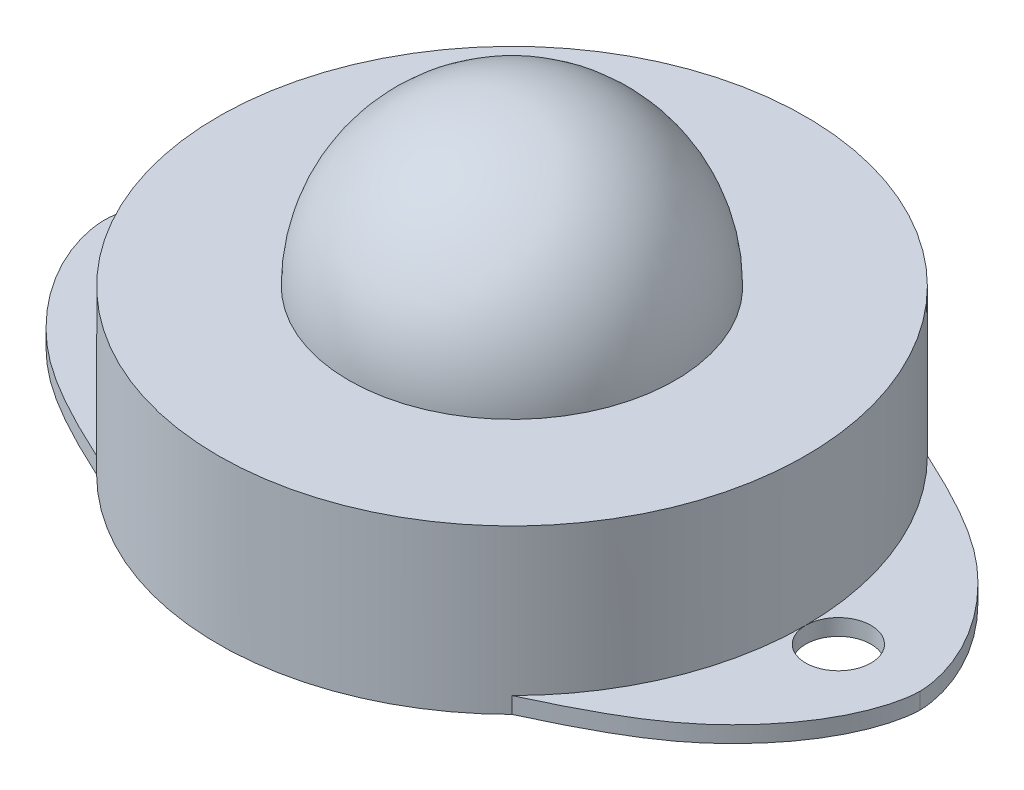
ISO-10303-21;
HEADER;
FILE_DESCRIPTION(('STEP AP214'),'2;1');
FILE_NAME('part.step','',(''),(''),'','','');
FILE_SCHEMA(('AUTOMOTIVE_DESIGN { 1 0 10303 214 1 1 1 1 }'));
ENDSEC;
DATA;
#1=APPLICATION_CONTEXT('core data for automotive mechanical design processes');
#2=APPLICATION_PROTOCOL_DEFINITION('international standard','automotive_design',2000,#1);
#3=PRODUCT_CONTEXT('',#1,'mechanical');
#4=PRODUCT('Part','Part','',(#3));
#5=PRODUCT_RELATED_PRODUCT_CATEGORY('part','',(#4));
#6=PRODUCT_DEFINITION_FORMATION('','',#4);
#7=PRODUCT_DEFINITION_CONTEXT('part definition',#1,'design');
#8=PRODUCT_DEFINITION('design','',#6,#7);
#9=PRODUCT_DEFINITION_SHAPE('','',#8);
#10=(LENGTH_UNIT() NAMED_UNIT(*) SI_UNIT(.MILLI.,.METRE.));
#11=(NAMED_UNIT(*) PLANE_ANGLE_UNIT() SI_UNIT($,.RADIAN.));
#12=(NAMED_UNIT(*) SI_UNIT($,.STERADIAN.) SOLID_ANGLE_UNIT());
#13=UNCERTAINTY_MEASURE_WITH_UNIT(LENGTH_MEASURE(1.E-05),#10,'distance_accuracy_value','');
#14=(GEOMETRIC_REPRESENTATION_CONTEXT(3) GLOBAL_UNCERTAINTY_ASSIGNED_CONTEXT((#13)) GLOBAL_UNIT_ASSIGNED_CONTEXT((#10,
#11,#12)) REPRESENTATION_CONTEXT('',''));
#15=CARTESIAN_POINT('',(0.,0.,0.));
#16=DIRECTION('',(0.,0.,1.));
#17=DIRECTION('',(1.,0.,0.));
#18=AXIS2_PLACEMENT_3D('',#15,#16,#17);
#19=CARTESIAN_POINT('',(0.,10.,0.));
#20=DIRECTION('',(0.,-1.,0.));
#21=DIRECTION('',(0.,0.,-1.));
#22=AXIS2_PLACEMENT_3D('',#19,#20,#21);
#23=CYLINDRICAL_SURFACE('',#22,18.);
#24=CARTESIAN_POINT('',(0.,1.,0.));
#25=DIRECTION('',(0.,-1.,0.));
#26=DIRECTION('',(0.,0.,-1.));
#27=AXIS2_PLACEMENT_3D('',#24,#25,#26);
#28=CIRCLE('',#27,18.);
#29=CARTESIAN_POINT('',(18.,1.,0.));
#30=VERTEX_POINT('',#29);
#31=CARTESIAN_POINT('',(12.7279220613579,0.999999999999999,12.7279220613578));
#32=VERTEX_POINT('',#31);
#33=EDGE_CURVE('E103',#30,#32,#28,.T.);
#34=ORIENTED_EDGE('',*,*,#33,.F.);
#35=CARTESIAN_POINT('',(12.7279220613579,0.999999999999999,-12.7279220613578));
#36=VERTEX_POINT('',#35);
#37=EDGE_CURVE('E122',#36,#30,#28,.T.);
#38=ORIENTED_EDGE('',*,*,#37,.F.);
#39=DIRECTION('',(0.,-1.,0.));
#40=VECTOR('',#39,1.);
#41=CARTESIAN_POINT('',(12.7279220613579,1.,-12.7279220613578));
#42=LINE('',#41,#40);
#43=CARTESIAN_POINT('',(12.7279220613579,0.,-12.7279220613578));
#44=VERTEX_POINT('',#43);
#45=EDGE_CURVE('E107',#36,#44,#42,.T.);
#46=ORIENTED_EDGE('',*,*,#45,.T.);
#47=CARTESIAN_POINT('',(0.,0.,0.));
#48=DIRECTION('',(0.,1.,0.));
#49=DIRECTION('',(0.,0.,1.));
#50=AXIS2_PLACEMENT_3D('',#47,#48,#49);
#51=CIRCLE('',#50,18.);
#52=CARTESIAN_POINT('',(-12.7279220613579,0.,-12.7279220613578));
#53=VERTEX_POINT('',#52);
#54=EDGE_CURVE('E184',#44,#53,#51,.T.);
#55=ORIENTED_EDGE('',*,*,#54,.T.);
#56=DIRECTION('',(0.,-1.,0.));
#57=VECTOR('',#56,1.);
#58=CARTESIAN_POINT('',(-12.7279220613579,1.,-12.7279220613578));
#59=LINE('',#58,#57);
#60=CARTESIAN_POINT('',(-12.7279220613579,0.999999999999999,-12.7279220613578));
#61=VERTEX_POINT('',#60);
#62=EDGE_CURVE('E160',#61,#53,#59,.T.);
#63=ORIENTED_EDGE('',*,*,#62,.F.);
#64=CARTESIAN_POINT('',(0.,1.,0.));
#65=DIRECTION('',(0.,-1.,0.));
#66=DIRECTION('',(0.,0.,-1.));
#67=AXIS2_PLACEMENT_3D('',#64,#65,#66);
#68=CIRCLE('',#67,18.);
#69=CARTESIAN_POINT('',(-18.,1.,0.));
#70=VERTEX_POINT('',#69);
#71=EDGE_CURVE('E237',#70,#61,#68,.T.);
#72=ORIENTED_EDGE('',*,*,#71,.F.);
#73=CARTESIAN_POINT('',(-12.7279220613579,0.999999999999999,12.7279220613578));
#74=VERTEX_POINT('',#73);
#75=EDGE_CURVE('E161',#74,#70,#68,.T.);
#76=ORIENTED_EDGE('',*,*,#75,.F.);
#77=DIRECTION('',(0.,-1.,0.));
#78=VECTOR('',#77,1.);
#79=CARTESIAN_POINT('',(-12.7279220613579,1.,12.7279220613578));
#80=LINE('',#79,#78);
#81=CARTESIAN_POINT('',(-12.7279220613579,0.,12.7279220613578));
#82=VERTEX_POINT('',#81);
#83=EDGE_CURVE('E185',#74,#82,#80,.T.);
#84=ORIENTED_EDGE('',*,*,#83,.T.);
#85=CARTESIAN_POINT('',(12.7279220613579,0.,12.7279220613578));
#86=VERTEX_POINT('',#85);
#87=EDGE_CURVE('E45',#82,#86,#51,.T.);
#88=ORIENTED_EDGE('',*,*,#87,.T.);
#89=DIRECTION('',(0.,-1.,0.));
#90=VECTOR('',#89,1.);
#91=CARTESIAN_POINT('',(12.7279220613579,1.,12.7279220613578));
#92=LINE('',#91,#90);
#93=EDGE_CURVE('E117',#32,#86,#92,.T.);
#94=ORIENTED_EDGE('',*,*,#93,.F.);
#95=EDGE_LOOP('',(#34,#38,#46,#55,#63,#72,#76,#84,#88,#94));
#96=FACE_BOUND('',#95,.T.);
#97=CARTESIAN_POINT('',(0.,10.,0.));
#98=DIRECTION('',(0.,1.,0.));
#99=DIRECTION('',(0.,0.,1.));
#100=AXIS2_PLACEMENT_3D('',#97,#98,#99);
#101=CIRCLE('',#100,18.);
#102=CARTESIAN_POINT('',(0.,10.,18.));
#103=VERTEX_POINT('',#102);
#104=EDGE_CURVE('E11',#103,#103,#101,.T.);
#105=ORIENTED_EDGE('',*,*,#104,.F.);
#106=EDGE_LOOP('',(#105));
#107=FACE_BOUND('',#106,.T.);
#108=ADVANCED_FACE('F37',(#96,#107),#23,.T.);
#109=CARTESIAN_POINT('',(0.,10.,0.));
#110=DIRECTION('',(0.,1.,0.));
#111=DIRECTION('',(0.,0.,1.));
#112=AXIS2_PLACEMENT_3D('',#109,#110,#111);
#113=PLANE('',#112);
#114=CARTESIAN_POINT('',(0.,10.,0.));
#115=DIRECTION('',(0.,1.,0.));
#116=DIRECTION('',(0.,0.,1.));
#117=AXIS2_PLACEMENT_3D('',#114,#115,#116);
#118=CIRCLE('',#117,10.);
#119=CARTESIAN_POINT('',(0.,10.,10.));
#120=VERTEX_POINT('',#119);
#121=EDGE_CURVE('E40',#120,#120,#118,.F.);
#122=ORIENTED_EDGE('',*,*,#121,.T.);
#123=EDGE_LOOP('',(#122));
#124=FACE_BOUND('',#123,.T.);
#125=ORIENTED_EDGE('',*,*,#104,.T.);
#126=EDGE_LOOP('',(#125));
#127=FACE_BOUND('',#126,.T.);
#128=ADVANCED_FACE('F204',(#124,#127),#113,.T.);
#129=CARTESIAN_POINT('',(0.,0.,0.));
#130=DIRECTION('',(0.,1.,0.));
#131=DIRECTION('',(0.,0.,1.));
#132=AXIS2_PLACEMENT_3D('',#129,#130,#131);
#133=PLANE('',#132);
#134=CARTESIAN_POINT('',(0.,0.,0.));
#135=VERTEX_POINT('',#134);
#136=VERTEX_LOOP('',#135);
#137=FACE_BOUND('',#136,.T.);
#138=CARTESIAN_POINT('',(20.,0.,0.));
#139=DIRECTION('',(0.,-1.,0.));
#140=DIRECTION('',(0.,0.,-1.));
#141=AXIS2_PLACEMENT_3D('',#138,#139,#140);
#142=CIRCLE('',#141,2.);
#143=CARTESIAN_POINT('',(20.,0.,-2.));
#144=VERTEX_POINT('',#143);
#145=EDGE_CURVE('E195',#144,#144,#142,.T.);
#146=ORIENTED_EDGE('',*,*,#145,.F.);
#147=EDGE_LOOP('',(#146));
#148=FACE_BOUND('',#147,.T.);
#149=CARTESIAN_POINT('',(-20.,0.,0.));
#150=DIRECTION('',(0.,-1.,0.));
#151=DIRECTION('',(0.,0.,-1.));
#152=AXIS2_PLACEMENT_3D('',#149,#150,#151);
#153=CIRCLE('',#152,2.);
#154=CARTESIAN_POINT('',(-20.,0.,-2.));
#155=VERTEX_POINT('',#154);
#156=EDGE_CURVE('E194',#155,#155,#153,.T.);
#157=ORIENTED_EDGE('',*,*,#156,.F.);
#158=EDGE_LOOP('',(#157));
#159=FACE_BOUND('',#158,.T.);
#160=ORIENTED_EDGE('',*,*,#87,.F.);
#161=CARTESIAN_POINT('',(-12.7279220613579,0.,12.7279220613578));
#162=CARTESIAN_POINT('',(-17.413514116372,0.,10.5789412860504));
#163=CARTESIAN_POINT('',(-23.9251464222868,0.,5.76683159903035));
#164=CARTESIAN_POINT('',(-25.,0.,1.29391370312394));
#165=CARTESIAN_POINT('',(-25.,0.,0.));
#166=B_SPLINE_CURVE_WITH_KNOTS('',3,(#161,#162,#163,#164,#165),.UNSPECIFIED.,.F.,.F.,(4,1,4),
(0.,0.294966876513877,1.),.UNSPECIFIED.);
#167=CARTESIAN_POINT('',(-25.,0.,0.));
#168=VERTEX_POINT('',#167);
#169=EDGE_CURVE('E170',#82,#168,#166,.T.);
#170=ORIENTED_EDGE('',*,*,#169,.T.);
#171=CARTESIAN_POINT('',(-12.7279220613579,0.,-12.7279220613578));
#172=CARTESIAN_POINT('',(-17.413514116372,0.,-10.5789412860504));
#173=CARTESIAN_POINT('',(-23.9251464222868,0.,-5.76683159903035));
#174=CARTESIAN_POINT('',(-25.,0.,-1.29391370312394));
#175=CARTESIAN_POINT('',(-25.,0.,0.));
#176=B_SPLINE_CURVE_WITH_KNOTS('',3,(#171,#172,#173,#174,#175),.UNSPECIFIED.,.F.,.F.,(4,1,4),
(0.,0.294966876513877,1.),.UNSPECIFIED.);
#177=EDGE_CURVE('E162',#53,#168,#176,.T.);
#178=ORIENTED_EDGE('',*,*,#177,.F.);
#179=ORIENTED_EDGE('',*,*,#54,.F.);
#180=CARTESIAN_POINT('',(12.7279220613579,0.,-12.7279220613578));
#181=CARTESIAN_POINT('',(17.413514116372,0.,-10.5789412860504));
#182=CARTESIAN_POINT('',(23.9251464222868,0.,-5.76683159903034));
#183=CARTESIAN_POINT('',(25.,0.,-1.29391370312393));
#184=CARTESIAN_POINT('',(25.,0.,0.));
#185=B_SPLINE_CURVE_WITH_KNOTS('',3,(#180,#181,#182,#183,#184),.UNSPECIFIED.,.F.,.F.,(4,1,4),
(0.,0.294966876513877,1.),.UNSPECIFIED.);
#186=CARTESIAN_POINT('',(25.,0.,0.));
#187=VERTEX_POINT('',#186);
#188=EDGE_CURVE('E193',#44,#187,#185,.T.);
#189=ORIENTED_EDGE('',*,*,#188,.T.);
#190=CARTESIAN_POINT('',(12.7279220613579,0.,12.7279220613578));
#191=CARTESIAN_POINT('',(17.413514116372,0.,10.5789412860504));
#192=CARTESIAN_POINT('',(23.9251464222868,0.,5.76683159903034));
#193=CARTESIAN_POINT('',(25.,0.,1.29391370312394));
#194=CARTESIAN_POINT('',(25.,0.,0.));
#195=B_SPLINE_CURVE_WITH_KNOTS('',3,(#190,#191,#192,#193,#194),.UNSPECIFIED.,.F.,.F.,(4,1,4),
(0.,0.294966876513877,1.),.UNSPECIFIED.);
#196=EDGE_CURVE('E113',#86,#187,#195,.T.);
#197=ORIENTED_EDGE('',*,*,#196,.F.);
#198=EDGE_LOOP('',(#160,#170,#178,#179,#189,#197));
#199=FACE_BOUND('',#198,.T.);
#200=ADVANCED_FACE('F221',(#137,#148,#159,#199),#133,.F.);
#201=CARTESIAN_POINT('',(-12.7279220613579,1.,-12.7279220613578));
#202=CARTESIAN_POINT('',(-17.413514116372,1.,-10.5789412860504));
#203=CARTESIAN_POINT('',(-23.9251464222868,1.,-5.76683159903035));
#204=CARTESIAN_POINT('',(-25.,1.,-1.29391370312394));
#205=CARTESIAN_POINT('',(-25.,1.,0.));
#206=B_SPLINE_CURVE_WITH_KNOTS('',3,(#201,#202,#203,#204,#205),.UNSPECIFIED.,.F.,.F.,(4,1,4),
(0.,0.294966876513877,1.),.UNSPECIFIED.);
#207=DIRECTION('',(0.,-1.,0.));
#208=VECTOR('',#207,1.);
#209=SURFACE_OF_LINEAR_EXTRUSION('',#206,#208);
#210=ORIENTED_EDGE('',*,*,#177,.T.);
#211=DIRECTION('',(0.,-1.,0.));
#212=VECTOR('',#211,1.);
#213=CARTESIAN_POINT('',(-25.,1.,0.));
#214=LINE('',#213,#212);
#215=CARTESIAN_POINT('',(-25.,1.,0.));
#216=VERTEX_POINT('',#215);
#217=EDGE_CURVE('E179',#216,#168,#214,.T.);
#218=ORIENTED_EDGE('',*,*,#217,.F.);
#219=EDGE_CURVE('E178',#61,#216,#206,.T.);
#220=ORIENTED_EDGE('',*,*,#219,.F.);
#221=ORIENTED_EDGE('',*,*,#62,.T.);
#222=EDGE_LOOP('',(#210,#218,#220,#221));
#223=FACE_BOUND('',#222,.T.);
#224=ADVANCED_FACE('F149',(#223),#209,.F.);
#225=CARTESIAN_POINT('',(-12.7279220613579,1.,12.7279220613578));
#226=CARTESIAN_POINT('',(-17.413514116372,1.,10.5789412860504));
#227=CARTESIAN_POINT('',(-23.9251464222868,1.,5.76683159903035));
#228=CARTESIAN_POINT('',(-25.,1.,1.29391370312394));
#229=CARTESIAN_POINT('',(-25.,1.,0.));
#230=B_SPLINE_CURVE_WITH_KNOTS('',3,(#225,#226,#227,#228,#229),.UNSPECIFIED.,.F.,.F.,(4,1,4),
(0.,0.294966876513877,1.),.UNSPECIFIED.);
#231=DIRECTION('',(0.,-1.,0.));
#232=VECTOR('',#231,1.);
#233=SURFACE_OF_LINEAR_EXTRUSION('',#230,#232);
#234=ORIENTED_EDGE('',*,*,#169,.F.);
#235=ORIENTED_EDGE('',*,*,#83,.F.);
#236=EDGE_CURVE('E153',#74,#216,#230,.T.);
#237=ORIENTED_EDGE('',*,*,#236,.T.);
#238=ORIENTED_EDGE('',*,*,#217,.T.);
#239=EDGE_LOOP('',(#234,#235,#237,#238));
#240=FACE_BOUND('',#239,.T.);
#241=ADVANCED_FACE('F144',(#240),#233,.T.);
#242=CARTESIAN_POINT('',(0.,1.,0.));
#243=DIRECTION('',(0.,-1.,0.));
#244=DIRECTION('',(0.,0.,-1.));
#245=AXIS2_PLACEMENT_3D('',#242,#243,#244);
#246=PLANE('',#245);
#247=ORIENTED_EDGE('',*,*,#75,.T.);
#248=CARTESIAN_POINT('',(-20.,1.,0.));
#249=DIRECTION('',(0.,-1.,0.));
#250=DIRECTION('',(0.,0.,-1.));
#251=AXIS2_PLACEMENT_3D('',#248,#249,#250);
#252=CIRCLE('',#251,2.);
#253=EDGE_CURVE('E191',#70,#70,#252,.T.);
#254=ORIENTED_EDGE('',*,*,#253,.T.);
#255=ORIENTED_EDGE('',*,*,#71,.T.);
#256=ORIENTED_EDGE('',*,*,#219,.T.);
#257=ORIENTED_EDGE('',*,*,#236,.F.);
#258=EDGE_LOOP('',(#247,#254,#255,#256,#257));
#259=FACE_BOUND('',#258,.T.);
#260=ADVANCED_FACE('F141',(#259),#246,.F.);
#261=CARTESIAN_POINT('',(12.7279220613579,1.,12.7279220613578));
#262=CARTESIAN_POINT('',(17.413514116372,1.,10.5789412860504));
#263=CARTESIAN_POINT('',(23.9251464222868,1.,5.76683159903034));
#264=CARTESIAN_POINT('',(25.,1.,1.29391370312394));
#265=CARTESIAN_POINT('',(25.,1.,0.));
#266=B_SPLINE_CURVE_WITH_KNOTS('',3,(#261,#262,#263,#264,#265),.UNSPECIFIED.,.F.,.F.,(4,1,4),
(0.,0.294966876513877,1.),.UNSPECIFIED.);
#267=DIRECTION('',(0.,-1.,0.));
#268=VECTOR('',#267,1.);
#269=SURFACE_OF_LINEAR_EXTRUSION('',#266,#268);
#270=ORIENTED_EDGE('',*,*,#196,.T.);
#271=DIRECTION('',(0.,-1.,0.));
#272=VECTOR('',#271,1.);
#273=CARTESIAN_POINT('',(25.,1.,0.));
#274=LINE('',#273,#272);
#275=CARTESIAN_POINT('',(25.,1.,0.));
#276=VERTEX_POINT('',#275);
#277=EDGE_CURVE('E110',#276,#187,#274,.T.);
#278=ORIENTED_EDGE('',*,*,#277,.F.);
#279=EDGE_CURVE('E96',#32,#276,#266,.T.);
#280=ORIENTED_EDGE('',*,*,#279,.F.);
#281=ORIENTED_EDGE('',*,*,#93,.T.);
#282=EDGE_LOOP('',(#270,#278,#280,#281));
#283=FACE_BOUND('',#282,.T.);
#284=ADVANCED_FACE('F111',(#283),#269,.F.);
#285=CARTESIAN_POINT('',(12.7279220613579,1.,-12.7279220613578));
#286=CARTESIAN_POINT('',(17.413514116372,1.,-10.5789412860504));
#287=CARTESIAN_POINT('',(23.9251464222868,1.,-5.76683159903034));
#288=CARTESIAN_POINT('',(25.,1.,-1.29391370312393));
#289=CARTESIAN_POINT('',(25.,1.,0.));
#290=B_SPLINE_CURVE_WITH_KNOTS('',3,(#285,#286,#287,#288,#289),.UNSPECIFIED.,.F.,.F.,(4,1,4),
(0.,0.294966876513877,1.),.UNSPECIFIED.);
#291=DIRECTION('',(0.,-1.,0.));
#292=VECTOR('',#291,1.);
#293=SURFACE_OF_LINEAR_EXTRUSION('',#290,#292);
#294=ORIENTED_EDGE('',*,*,#188,.F.);
#295=ORIENTED_EDGE('',*,*,#45,.F.);
#296=EDGE_CURVE('E101',#36,#276,#290,.T.);
#297=ORIENTED_EDGE('',*,*,#296,.T.);
#298=ORIENTED_EDGE('',*,*,#277,.T.);
#299=EDGE_LOOP('',(#294,#295,#297,#298));
#300=FACE_BOUND('',#299,.T.);
#301=ADVANCED_FACE('F120',(#300),#293,.T.);
#302=CARTESIAN_POINT('',(0.,1.,0.));
#303=DIRECTION('',(0.,-1.,0.));
#304=DIRECTION('',(0.,0.,-1.));
#305=AXIS2_PLACEMENT_3D('',#302,#303,#304);
#306=PLANE('',#305);
#307=ORIENTED_EDGE('',*,*,#37,.T.);
#308=CARTESIAN_POINT('',(20.,1.,0.));
#309=DIRECTION('',(0.,-1.,0.));
#310=DIRECTION('',(0.,0.,-1.));
#311=AXIS2_PLACEMENT_3D('',#308,#309,#310);
#312=CIRCLE('',#311,2.);
#313=EDGE_CURVE('E54',#30,#30,#312,.T.);
#314=ORIENTED_EDGE('',*,*,#313,.T.);
#315=ORIENTED_EDGE('',*,*,#33,.T.);
#316=ORIENTED_EDGE('',*,*,#279,.T.);
#317=ORIENTED_EDGE('',*,*,#296,.F.);
#318=EDGE_LOOP('',(#307,#314,#315,#316,#317));
#319=FACE_BOUND('',#318,.T.);
#320=ADVANCED_FACE('F99',(#319),#306,.F.);
#321=CARTESIAN_POINT('',(-20.,2.,0.));
#322=DIRECTION('',(0.,-1.,0.));
#323=DIRECTION('',(0.,0.,-1.));
#324=AXIS2_PLACEMENT_3D('',#321,#322,#323);
#325=CYLINDRICAL_SURFACE('',#324,2.);
#326=ORIENTED_EDGE('',*,*,#156,.T.);
#327=EDGE_LOOP('',(#326));
#328=FACE_BOUND('',#327,.T.);
#329=ORIENTED_EDGE('',*,*,#253,.F.);
#330=EDGE_LOOP('',(#329));
#331=FACE_BOUND('',#330,.T.);
#332=ADVANCED_FACE('F214',(#328,#331),#325,.F.);
#333=CARTESIAN_POINT('',(20.,2.,0.));
#334=DIRECTION('',(0.,-1.,0.));
#335=DIRECTION('',(0.,0.,-1.));
#336=AXIS2_PLACEMENT_3D('',#333,#334,#335);
#337=CYLINDRICAL_SURFACE('',#336,2.);
#338=ORIENTED_EDGE('',*,*,#145,.T.);
#339=EDGE_LOOP('',(#338));
#340=FACE_BOUND('',#339,.T.);
#341=ORIENTED_EDGE('',*,*,#313,.F.);
#342=EDGE_LOOP('',(#341));
#343=FACE_BOUND('',#342,.T.);
#344=ADVANCED_FACE('F209',(#340,#343),#337,.F.);
#345=CARTESIAN_POINT('',(0.,10.,0.));
#346=DIRECTION('',(0.,0.,-1.));
#347=DIRECTION('',(1.,0.,0.));
#348=AXIS2_PLACEMENT_3D('',#345,#346,#347);
#349=SPHERICAL_SURFACE('',#348,10.);
#350=CARTESIAN_POINT('',(0.,10.,0.));
#351=DIRECTION('',(0.,1.,0.));
#352=DIRECTION('',(0.,0.,1.));
#353=AXIS2_PLACEMENT_3D('',#350,#351,#352);
#354=SPHERICAL_SURFACE('',#353,10.);
#355=ORIENTED_EDGE('',*,*,#121,.F.);
#356=EDGE_LOOP('',(#355));
#357=FACE_BOUND('',#356,.T.);
#358=ADVANCED_FACE('F207',(#357),#354,.T.);
#359=CLOSED_SHELL('',(#108,#128,#200,#224,#241,#260,#284,#301,#320,#332,#344,#358));
#360=MANIFOLD_SOLID_BREP('B2',#359);
#361=ADVANCED_BREP_SHAPE_REPRESENTATION('',(#18,#360),#14);
#362=SHAPE_DEFINITION_REPRESENTATION(#9,#361);
ENDSEC;
END-ISO-10303-21;
